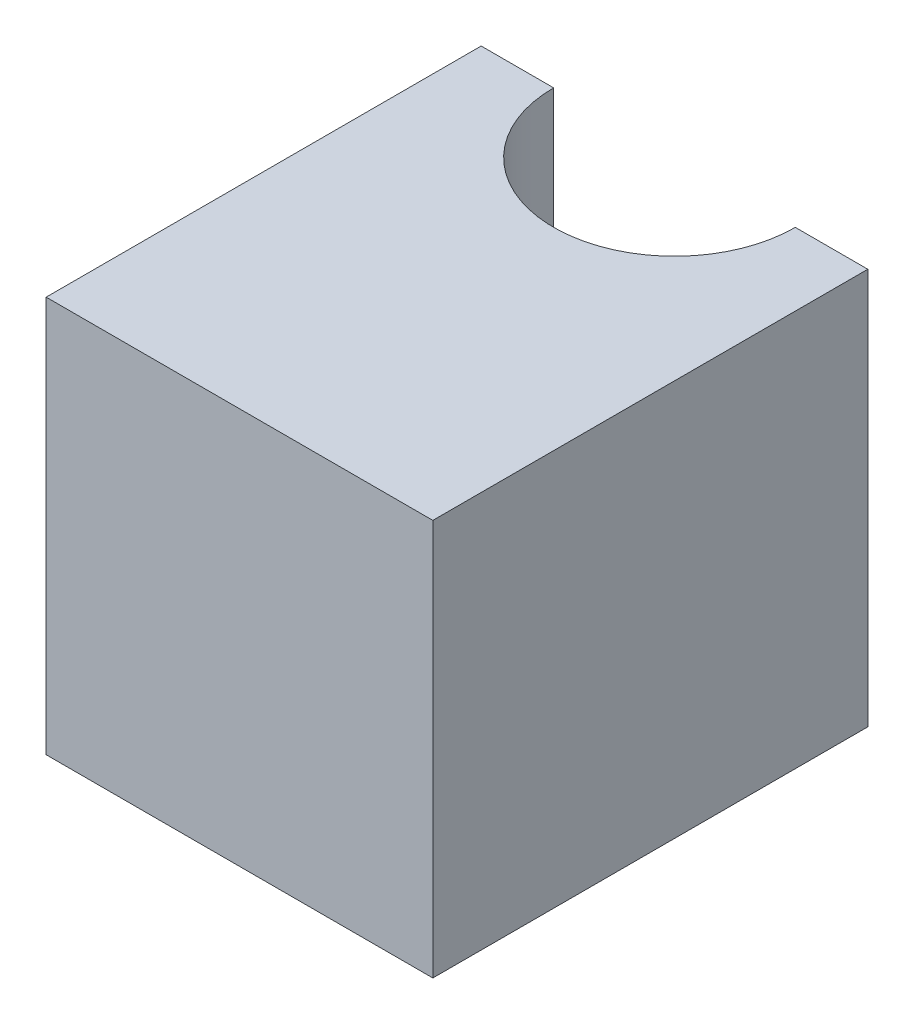
ISO-10303-21;
HEADER;
FILE_DESCRIPTION(('STEP AP214'),'2;1');
FILE_NAME('part.step','',(''),(''),'','','');
FILE_SCHEMA(('AUTOMOTIVE_DESIGN { 1 0 10303 214 1 1 1 1 }'));
ENDSEC;
DATA;
#1=APPLICATION_CONTEXT('core data for automotive mechanical design processes');
#2=APPLICATION_PROTOCOL_DEFINITION('international standard','automotive_design',2000,#1);
#3=PRODUCT_CONTEXT('',#1,'mechanical');
#4=PRODUCT('Part','Part','',(#3));
#5=PRODUCT_RELATED_PRODUCT_CATEGORY('part','',(#4));
#6=PRODUCT_DEFINITION_FORMATION('','',#4);
#7=PRODUCT_DEFINITION_CONTEXT('part definition',#1,'design');
#8=PRODUCT_DEFINITION('design','',#6,#7);
#9=PRODUCT_DEFINITION_SHAPE('','',#8);
#10=(LENGTH_UNIT() NAMED_UNIT(*) SI_UNIT(.MILLI.,.METRE.));
#11=(NAMED_UNIT(*) PLANE_ANGLE_UNIT() SI_UNIT($,.RADIAN.));
#12=(NAMED_UNIT(*) SI_UNIT($,.STERADIAN.) SOLID_ANGLE_UNIT());
#13=UNCERTAINTY_MEASURE_WITH_UNIT(LENGTH_MEASURE(1.E-05),#10,'distance_accuracy_value','');
#14=(GEOMETRIC_REPRESENTATION_CONTEXT(3) GLOBAL_UNCERTAINTY_ASSIGNED_CONTEXT((#13)) GLOBAL_UNIT_ASSIGNED_CONTEXT((#10,
#11,#12)) REPRESENTATION_CONTEXT('',''));
#15=CARTESIAN_POINT('',(0.,0.,0.));
#16=DIRECTION('',(0.,0.,1.));
#17=DIRECTION('',(1.,0.,0.));
#18=AXIS2_PLACEMENT_3D('',#15,#16,#17);
#19=CARTESIAN_POINT('',(7.4,0.,-5.2));
#20=DIRECTION('',(1.,0.,0.));
#21=DIRECTION('',(0.,0.,-1.));
#22=AXIS2_PLACEMENT_3D('',#19,#20,#21);
#23=PLANE('',#22);
#24=DIRECTION('',(0.,0.,1.));
#25=VECTOR('',#24,1.);
#26=CARTESIAN_POINT('',(7.4,0.82,-5.65));
#27=LINE('',#26,#25);
#28=CARTESIAN_POINT('',(7.4,0.82,-5.2));
#29=VERTEX_POINT('',#28);
#30=CARTESIAN_POINT('',(7.4,0.82,-6.1));
#31=VERTEX_POINT('',#30);
#32=EDGE_CURVE('E108',#29,#31,#27,.F.);
#33=ORIENTED_EDGE('',*,*,#32,.F.);
#34=DIRECTION('',(0.,1.,0.));
#35=VECTOR('',#34,1.);
#36=CARTESIAN_POINT('',(7.4,0.,-5.2));
#37=LINE('',#36,#35);
#38=CARTESIAN_POINT('',(7.4,0.,-5.2));
#39=VERTEX_POINT('',#38);
#40=EDGE_CURVE('E92',#39,#29,#37,.T.);
#41=ORIENTED_EDGE('',*,*,#40,.F.);
#42=DIRECTION('',(0.,0.,1.));
#43=VECTOR('',#42,1.);
#44=CARTESIAN_POINT('',(7.4,0.,-5.65));
#45=LINE('',#44,#43);
#46=CARTESIAN_POINT('',(7.4,0.,-6.1));
#47=VERTEX_POINT('',#46);
#48=EDGE_CURVE('E76',#39,#47,#45,.F.);
#49=ORIENTED_EDGE('',*,*,#48,.T.);
#50=DIRECTION('',(0.,1.,0.));
#51=VECTOR('',#50,1.);
#52=CARTESIAN_POINT('',(7.4,0.,-6.1));
#53=LINE('',#52,#51);
#54=EDGE_CURVE('E73',#31,#47,#53,.F.);
#55=ORIENTED_EDGE('',*,*,#54,.F.);
#56=EDGE_LOOP('',(#33,#41,#49,#55));
#57=FACE_BOUND('',#56,.T.);
#58=ADVANCED_FACE('F17',(#57),#23,.T.);
#59=CARTESIAN_POINT('',(7.4,0.,-6.1));
#60=DIRECTION('',(0.,0.,-1.));
#61=DIRECTION('',(-1.,0.,0.));
#62=AXIS2_PLACEMENT_3D('',#59,#60,#61);
#63=PLANE('',#62);
#64=DIRECTION('',(1.,0.,0.));
#65=VECTOR('',#64,1.);
#66=CARTESIAN_POINT('',(7.,0.82,-6.1));
#67=LINE('',#66,#65);
#68=CARTESIAN_POINT('',(7.25,0.82,-6.1));
#69=VERTEX_POINT('',#68);
#70=EDGE_CURVE('E106',#31,#69,#67,.F.);
#71=ORIENTED_EDGE('',*,*,#70,.F.);
#72=ORIENTED_EDGE('',*,*,#54,.T.);
#73=DIRECTION('',(1.,0.,0.));
#74=VECTOR('',#73,1.);
#75=CARTESIAN_POINT('',(7.,0.,-6.1));
#76=LINE('',#75,#74);
#77=CARTESIAN_POINT('',(7.25,0.,-6.1));
#78=VERTEX_POINT('',#77);
#79=EDGE_CURVE('E67',#47,#78,#76,.F.);
#80=ORIENTED_EDGE('',*,*,#79,.T.);
#81=DIRECTION('',(0.,1.,0.));
#82=VECTOR('',#81,1.);
#83=CARTESIAN_POINT('',(7.25,0.,-6.1));
#84=LINE('',#83,#82);
#85=EDGE_CURVE('E71',#78,#69,#84,.T.);
#86=ORIENTED_EDGE('',*,*,#85,.T.);
#87=EDGE_LOOP('',(#71,#72,#80,#86));
#88=FACE_BOUND('',#87,.T.);
#89=ADVANCED_FACE('F70',(#88),#63,.T.);
#90=CARTESIAN_POINT('',(7.,0.,-6.1));
#91=DIRECTION('',(0.,1.,0.));
#92=DIRECTION('',(0.,0.,1.));
#93=AXIS2_PLACEMENT_3D('',#90,#91,#92);
#94=CYLINDRICAL_SURFACE('',#93,0.25);
#95=DIRECTION('',(0.,1.,0.));
#96=VECTOR('',#95,1.);
#97=CARTESIAN_POINT('',(6.75,0.,-6.1));
#98=LINE('',#97,#96);
#99=CARTESIAN_POINT('',(6.75,0.82,-6.1));
#100=VERTEX_POINT('',#99);
#101=CARTESIAN_POINT('',(6.75,0.,-6.1));
#102=VERTEX_POINT('',#101);
#103=EDGE_CURVE('E117',#100,#102,#98,.F.);
#104=ORIENTED_EDGE('',*,*,#103,.F.);
#105=CARTESIAN_POINT('',(7.,0.82,-6.1));
#106=DIRECTION('',(0.,1.,0.));
#107=DIRECTION('',(0.,0.,1.));
#108=AXIS2_PLACEMENT_3D('',#105,#106,#107);
#109=CIRCLE('',#108,0.25);
#110=EDGE_CURVE('E83',#69,#100,#109,.F.);
#111=ORIENTED_EDGE('',*,*,#110,.F.);
#112=ORIENTED_EDGE('',*,*,#85,.F.);
#113=CARTESIAN_POINT('',(7.,0.,-6.1));
#114=DIRECTION('',(0.,1.,0.));
#115=DIRECTION('',(0.,0.,1.));
#116=AXIS2_PLACEMENT_3D('',#113,#114,#115);
#117=CIRCLE('',#116,0.25);
#118=EDGE_CURVE('E20',#78,#102,#117,.F.);
#119=ORIENTED_EDGE('',*,*,#118,.T.);
#120=EDGE_LOOP('',(#104,#111,#112,#119));
#121=FACE_BOUND('',#120,.T.);
#122=ADVANCED_FACE('F81',(#121),#94,.F.);
#123=CARTESIAN_POINT('',(7.,0.,-5.65));
#124=DIRECTION('',(0.,1.,0.));
#125=DIRECTION('',(0.,0.,1.));
#126=AXIS2_PLACEMENT_3D('',#123,#124,#125);
#127=PLANE('',#126);
#128=DIRECTION('',(0.,0.,1.));
#129=VECTOR('',#128,1.);
#130=CARTESIAN_POINT('',(6.6,0.,-6.1));
#131=LINE('',#130,#129);
#132=CARTESIAN_POINT('',(6.6,0.,-6.1));
#133=VERTEX_POINT('',#132);
#134=CARTESIAN_POINT('',(6.6,0.,-5.2));
#135=VERTEX_POINT('',#134);
#136=EDGE_CURVE('E119',#133,#135,#131,.T.);
#137=ORIENTED_EDGE('',*,*,#136,.F.);
#138=DIRECTION('',(-1.,0.,0.));
#139=VECTOR('',#138,1.);
#140=CARTESIAN_POINT('',(6.75,0.,-6.1));
#141=LINE('',#140,#139);
#142=EDGE_CURVE('E88',#102,#133,#141,.T.);
#143=ORIENTED_EDGE('',*,*,#142,.F.);
#144=ORIENTED_EDGE('',*,*,#118,.F.);
#145=ORIENTED_EDGE('',*,*,#79,.F.);
#146=ORIENTED_EDGE('',*,*,#48,.F.);
#147=DIRECTION('',(1.,0.,0.));
#148=VECTOR('',#147,1.);
#149=CARTESIAN_POINT('',(6.6,0.,-5.2));
#150=LINE('',#149,#148);
#151=EDGE_CURVE('E90',#135,#39,#150,.T.);
#152=ORIENTED_EDGE('',*,*,#151,.F.);
#153=EDGE_LOOP('',(#137,#143,#144,#145,#146,#152));
#154=FACE_BOUND('',#153,.T.);
#155=ADVANCED_FACE('F86',(#154),#127,.F.);
#156=CARTESIAN_POINT('',(6.6,0.,-5.2));
#157=DIRECTION('',(0.,0.,1.));
#158=DIRECTION('',(1.,0.,0.));
#159=AXIS2_PLACEMENT_3D('',#156,#157,#158);
#160=PLANE('',#159);
#161=DIRECTION('',(1.,0.,0.));
#162=VECTOR('',#161,1.);
#163=CARTESIAN_POINT('',(7.,0.82,-5.2));
#164=LINE('',#163,#162);
#165=CARTESIAN_POINT('',(6.6,0.82,-5.2));
#166=VERTEX_POINT('',#165);
#167=EDGE_CURVE('E96',#166,#29,#164,.T.);
#168=ORIENTED_EDGE('',*,*,#167,.F.);
#169=DIRECTION('',(0.,1.,0.));
#170=VECTOR('',#169,1.);
#171=CARTESIAN_POINT('',(6.6,0.,-5.2));
#172=LINE('',#171,#170);
#173=EDGE_CURVE('E127',#135,#166,#172,.T.);
#174=ORIENTED_EDGE('',*,*,#173,.F.);
#175=ORIENTED_EDGE('',*,*,#151,.T.);
#176=ORIENTED_EDGE('',*,*,#40,.T.);
#177=EDGE_LOOP('',(#168,#174,#175,#176));
#178=FACE_BOUND('',#177,.T.);
#179=ADVANCED_FACE('F149',(#178),#160,.T.);
#180=CARTESIAN_POINT('',(7.,0.82,-5.65));
#181=DIRECTION('',(0.,1.,0.));
#182=DIRECTION('',(0.,0.,1.));
#183=AXIS2_PLACEMENT_3D('',#180,#181,#182);
#184=PLANE('',#183);
#185=DIRECTION('',(-1.,0.,0.));
#186=VECTOR('',#185,1.);
#187=CARTESIAN_POINT('',(6.75,0.82,-6.1));
#188=LINE('',#187,#186);
#189=CARTESIAN_POINT('',(6.6,0.82,-6.1));
#190=VERTEX_POINT('',#189);
#191=EDGE_CURVE('E35',#190,#100,#188,.F.);
#192=ORIENTED_EDGE('',*,*,#191,.F.);
#193=DIRECTION('',(0.,0.,1.));
#194=VECTOR('',#193,1.);
#195=CARTESIAN_POINT('',(6.6,0.82,-6.1));
#196=LINE('',#195,#194);
#197=EDGE_CURVE('E26',#166,#190,#196,.F.);
#198=ORIENTED_EDGE('',*,*,#197,.F.);
#199=ORIENTED_EDGE('',*,*,#167,.T.);
#200=ORIENTED_EDGE('',*,*,#32,.T.);
#201=ORIENTED_EDGE('',*,*,#70,.T.);
#202=ORIENTED_EDGE('',*,*,#110,.T.);
#203=EDGE_LOOP('',(#192,#198,#199,#200,#201,#202));
#204=FACE_BOUND('',#203,.T.);
#205=ADVANCED_FACE('F152',(#204),#184,.T.);
#206=CARTESIAN_POINT('',(6.75,0.,-6.1));
#207=DIRECTION('',(0.,0.,-1.));
#208=DIRECTION('',(-1.,0.,0.));
#209=AXIS2_PLACEMENT_3D('',#206,#207,#208);
#210=PLANE('',#209);
#211=ORIENTED_EDGE('',*,*,#191,.T.);
#212=ORIENTED_EDGE('',*,*,#103,.T.);
#213=ORIENTED_EDGE('',*,*,#142,.T.);
#214=DIRECTION('',(0.,1.,0.));
#215=VECTOR('',#214,1.);
#216=CARTESIAN_POINT('',(6.6,0.,-6.1));
#217=LINE('',#216,#215);
#218=EDGE_CURVE('E11',#190,#133,#217,.F.);
#219=ORIENTED_EDGE('',*,*,#218,.F.);
#220=EDGE_LOOP('',(#211,#212,#213,#219));
#221=FACE_BOUND('',#220,.T.);
#222=ADVANCED_FACE('F154',(#221),#210,.T.);
#223=CARTESIAN_POINT('',(6.6,0.,-6.1));
#224=DIRECTION('',(-1.,0.,0.));
#225=DIRECTION('',(0.,0.,1.));
#226=AXIS2_PLACEMENT_3D('',#223,#224,#225);
#227=PLANE('',#226);
#228=ORIENTED_EDGE('',*,*,#197,.T.);
#229=ORIENTED_EDGE('',*,*,#218,.T.);
#230=ORIENTED_EDGE('',*,*,#136,.T.);
#231=ORIENTED_EDGE('',*,*,#173,.T.);
#232=EDGE_LOOP('',(#228,#229,#230,#231));
#233=FACE_BOUND('',#232,.T.);
#234=ADVANCED_FACE('F148',(#233),#227,.T.);
#235=CLOSED_SHELL('',(#58,#89,#122,#155,#179,#205,#222,#234));
#236=MANIFOLD_SOLID_BREP('B1',#235);
#237=ADVANCED_BREP_SHAPE_REPRESENTATION('',(#18,#236),#14);
#238=SHAPE_DEFINITION_REPRESENTATION(#9,#237);
ENDSEC;
END-ISO-10303-21;
